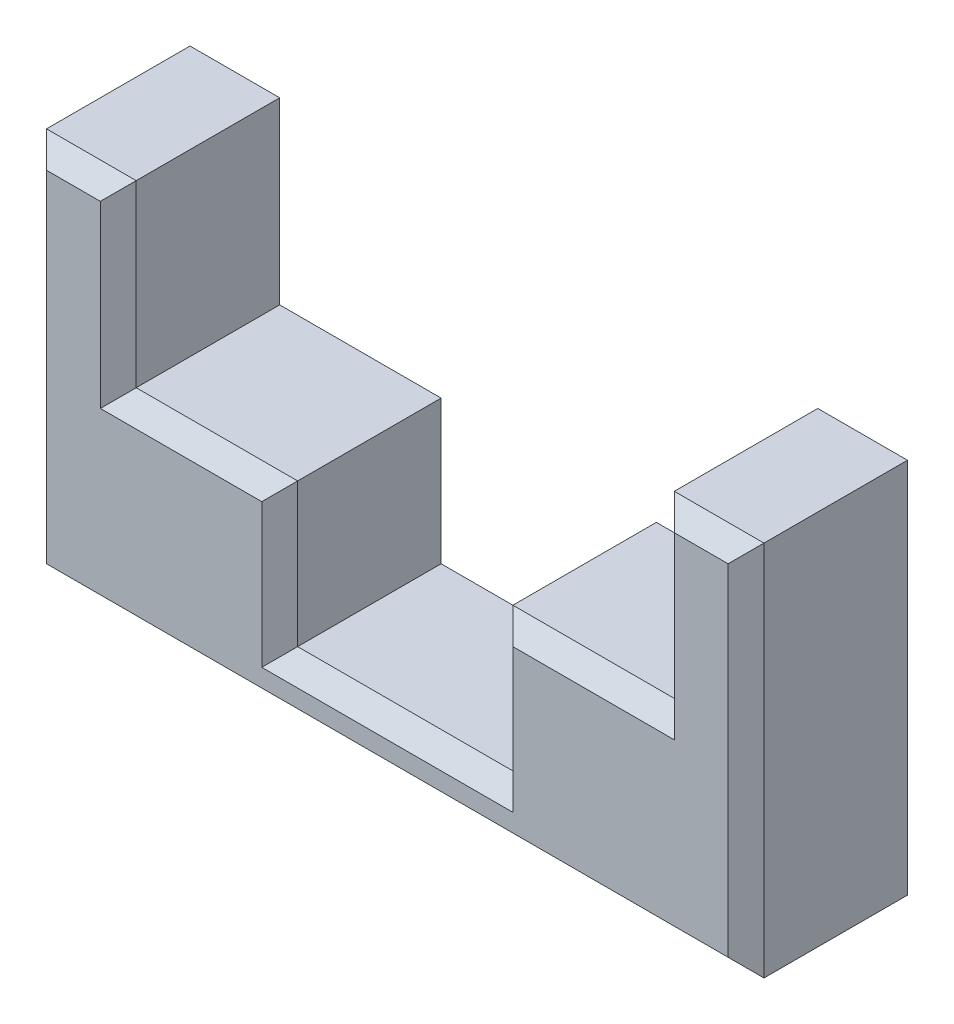
ISO-10303-21;
HEADER;
FILE_DESCRIPTION(('STEP AP214'),'2;1');
FILE_NAME('part.step','',(''),(''),'','','');
FILE_SCHEMA(('AUTOMOTIVE_DESIGN { 1 0 10303 214 1 1 1 1 }'));
ENDSEC;
DATA;
#1=APPLICATION_CONTEXT('core data for automotive mechanical design processes');
#2=APPLICATION_PROTOCOL_DEFINITION('international standard','automotive_design',2000,#1);
#3=PRODUCT_CONTEXT('',#1,'mechanical');
#4=PRODUCT('Part','Part','',(#3));
#5=PRODUCT_RELATED_PRODUCT_CATEGORY('part','',(#4));
#6=PRODUCT_DEFINITION_FORMATION('','',#4);
#7=PRODUCT_DEFINITION_CONTEXT('part definition',#1,'design');
#8=PRODUCT_DEFINITION('design','',#6,#7);
#9=PRODUCT_DEFINITION_SHAPE('','',#8);
#10=(LENGTH_UNIT() NAMED_UNIT(*) SI_UNIT(.MILLI.,.METRE.));
#11=(NAMED_UNIT(*) PLANE_ANGLE_UNIT() SI_UNIT($,.RADIAN.));
#12=(NAMED_UNIT(*) SI_UNIT($,.STERADIAN.) SOLID_ANGLE_UNIT());
#13=UNCERTAINTY_MEASURE_WITH_UNIT(LENGTH_MEASURE(1.E-05),#10,'distance_accuracy_value','');
#14=(GEOMETRIC_REPRESENTATION_CONTEXT(3) GLOBAL_UNCERTAINTY_ASSIGNED_CONTEXT((#13)) GLOBAL_UNIT_ASSIGNED_CONTEXT((#10,
#11,#12)) REPRESENTATION_CONTEXT('',''));
#15=CARTESIAN_POINT('',(0.,0.,0.));
#16=DIRECTION('',(0.,0.,1.));
#17=DIRECTION('',(1.,0.,0.));
#18=AXIS2_PLACEMENT_3D('',#15,#16,#17);
#19=CARTESIAN_POINT('',(15.7141207882353,0.,10.));
#20=DIRECTION('',(0.,-1.,0.));
#21=DIRECTION('',(0.,0.,-1.));
#22=AXIS2_PLACEMENT_3D('',#19,#20,#21);
#23=PLANE('',#22);
#24=DIRECTION('',(0.,0.,-1.));
#25=VECTOR('',#24,1.);
#26=CARTESIAN_POINT('',(15.7141207882353,0.,10.));
#27=LINE('',#26,#25);
#28=CARTESIAN_POINT('',(15.7141207882353,0.,9.));
#29=VERTEX_POINT('',#28);
#30=CARTESIAN_POINT('',(15.7141207882353,0.,1.));
#31=VERTEX_POINT('',#30);
#32=EDGE_CURVE('E217',#29,#31,#27,.T.);
#33=ORIENTED_EDGE('',*,*,#32,.F.);
#34=DIRECTION('',(1.,0.,0.));
#35=VECTOR('',#34,1.);
#36=CARTESIAN_POINT('',(20.7141207882353,0.,9.));
#37=LINE('',#36,#35);
#38=CARTESIAN_POINT('',(20.7141207882353,0.,9.));
#39=VERTEX_POINT('',#38);
#40=EDGE_CURVE('E274',#29,#39,#37,.T.);
#41=ORIENTED_EDGE('',*,*,#40,.T.);
#42=DIRECTION('',(0.,0.,-1.));
#43=VECTOR('',#42,1.);
#44=CARTESIAN_POINT('',(20.7141207882353,0.,10.));
#45=LINE('',#44,#43);
#46=CARTESIAN_POINT('',(20.7141207882353,0.,1.));
#47=VERTEX_POINT('',#46);
#48=EDGE_CURVE('E325',#39,#47,#45,.T.);
#49=ORIENTED_EDGE('',*,*,#48,.T.);
#50=DIRECTION('',(-1.,0.,0.));
#51=VECTOR('',#50,1.);
#52=CARTESIAN_POINT('',(15.7141207882353,0.,1.));
#53=LINE('',#52,#51);
#54=EDGE_CURVE('E272',#47,#31,#53,.T.);
#55=ORIENTED_EDGE('',*,*,#54,.T.);
#56=EDGE_LOOP('',(#33,#41,#49,#55));
#57=FACE_BOUND('',#56,.T.);
#58=ADVANCED_FACE('F35',(#57),#23,.F.);
#59=CARTESIAN_POINT('',(15.7141207882353,0.,10.));
#60=DIRECTION('',(1.,0.,0.));
#61=DIRECTION('',(0.,0.,-1.));
#62=AXIS2_PLACEMENT_3D('',#59,#60,#61);
#63=PLANE('',#62);
#64=DIRECTION('',(0.,0.,-1.));
#65=VECTOR('',#64,1.);
#66=CARTESIAN_POINT('',(15.7141207882353,-10.,10.));
#67=LINE('',#66,#65);
#68=CARTESIAN_POINT('',(15.7141207882353,-10.,9.));
#69=VERTEX_POINT('',#68);
#70=CARTESIAN_POINT('',(15.7141207882353,-10.,1.));
#71=VERTEX_POINT('',#70);
#72=EDGE_CURVE('E419',#69,#71,#67,.T.);
#73=ORIENTED_EDGE('',*,*,#72,.F.);
#74=DIRECTION('',(0.,1.,0.));
#75=VECTOR('',#74,1.);
#76=CARTESIAN_POINT('',(15.7141207882353,0.,9.));
#77=LINE('',#76,#75);
#78=EDGE_CURVE('E270',#69,#29,#77,.T.);
#79=ORIENTED_EDGE('',*,*,#78,.T.);
#80=ORIENTED_EDGE('',*,*,#32,.T.);
#81=DIRECTION('',(0.,-1.,0.));
#82=VECTOR('',#81,1.);
#83=CARTESIAN_POINT('',(15.7141207882353,0.,1.));
#84=LINE('',#83,#82);
#85=EDGE_CURVE('E267',#31,#71,#84,.T.);
#86=ORIENTED_EDGE('',*,*,#85,.T.);
#87=EDGE_LOOP('',(#73,#79,#80,#86));
#88=FACE_BOUND('',#87,.T.);
#89=ADVANCED_FACE('F516',(#88),#63,.F.);
#90=CARTESIAN_POINT('',(6.71412078823526,-10.,10.));
#91=DIRECTION('',(0.,-1.,0.));
#92=DIRECTION('',(1.,0.,0.));
#93=AXIS2_PLACEMENT_3D('',#90,#91,#92);
#94=PLANE('',#93);
#95=DIRECTION('',(0.,0.,-1.));
#96=VECTOR('',#95,1.);
#97=CARTESIAN_POINT('',(6.71412078823526,-10.,10.));
#98=LINE('',#97,#96);
#99=CARTESIAN_POINT('',(6.71412078823526,-10.,9.));
#100=VERTEX_POINT('',#99);
#101=CARTESIAN_POINT('',(6.71412078823526,-10.,1.));
#102=VERTEX_POINT('',#101);
#103=EDGE_CURVE('E416',#100,#102,#98,.T.);
#104=ORIENTED_EDGE('',*,*,#103,.F.);
#105=DIRECTION('',(1.,0.,0.));
#106=VECTOR('',#105,1.);
#107=CARTESIAN_POINT('',(15.7141207882353,-10.,9.));
#108=LINE('',#107,#106);
#109=EDGE_CURVE('E265',#100,#69,#108,.T.);
#110=ORIENTED_EDGE('',*,*,#109,.T.);
#111=ORIENTED_EDGE('',*,*,#72,.T.);
#112=DIRECTION('',(-1.,0.,0.));
#113=VECTOR('',#112,1.);
#114=CARTESIAN_POINT('',(6.71412078823526,-10.,1.));
#115=LINE('',#114,#113);
#116=EDGE_CURVE('E263',#71,#102,#115,.T.);
#117=ORIENTED_EDGE('',*,*,#116,.T.);
#118=EDGE_LOOP('',(#104,#110,#111,#117));
#119=FACE_BOUND('',#118,.T.);
#120=ADVANCED_FACE('F548',(#119),#94,.F.);
#121=CARTESIAN_POINT('',(6.71412078823526,-10.,10.));
#122=DIRECTION('',(1.,0.,0.));
#123=DIRECTION('',(0.,0.,-1.));
#124=AXIS2_PLACEMENT_3D('',#121,#122,#123);
#125=PLANE('',#124);
#126=DIRECTION('',(0.,0.,-1.));
#127=VECTOR('',#126,1.);
#128=CARTESIAN_POINT('',(6.71412078823526,-18.,10.));
#129=LINE('',#128,#127);
#130=CARTESIAN_POINT('',(6.71412078823526,-18.,9.));
#131=VERTEX_POINT('',#130);
#132=CARTESIAN_POINT('',(6.71412078823526,-18.,1.));
#133=VERTEX_POINT('',#132);
#134=EDGE_CURVE('E413',#131,#133,#129,.T.);
#135=ORIENTED_EDGE('',*,*,#134,.F.);
#136=DIRECTION('',(0.,1.,0.));
#137=VECTOR('',#136,1.);
#138=CARTESIAN_POINT('',(6.71412078823526,-10.,9.));
#139=LINE('',#138,#137);
#140=EDGE_CURVE('E261',#131,#100,#139,.T.);
#141=ORIENTED_EDGE('',*,*,#140,.T.);
#142=ORIENTED_EDGE('',*,*,#103,.T.);
#143=DIRECTION('',(0.,-1.,0.));
#144=VECTOR('',#143,1.);
#145=CARTESIAN_POINT('',(6.71412078823526,-10.,1.));
#146=LINE('',#145,#144);
#147=EDGE_CURVE('E259',#102,#133,#146,.T.);
#148=ORIENTED_EDGE('',*,*,#147,.T.);
#149=EDGE_LOOP('',(#135,#141,#142,#148));
#150=FACE_BOUND('',#149,.T.);
#151=ADVANCED_FACE('F799',(#150),#125,.F.);
#152=CARTESIAN_POINT('',(-5.28587921176474,-18.,10.));
#153=DIRECTION('',(0.,-1.,0.));
#154=DIRECTION('',(0.,0.,-1.));
#155=AXIS2_PLACEMENT_3D('',#152,#153,#154);
#156=PLANE('',#155);
#157=DIRECTION('',(0.,0.,-1.));
#158=VECTOR('',#157,1.);
#159=CARTESIAN_POINT('',(-5.28587921176474,-18.,10.));
#160=LINE('',#159,#158);
#161=CARTESIAN_POINT('',(-5.28587921176474,-18.,9.));
#162=VERTEX_POINT('',#161);
#163=CARTESIAN_POINT('',(-5.28587921176474,-18.,1.));
#164=VERTEX_POINT('',#163);
#165=EDGE_CURVE('E410',#162,#164,#160,.T.);
#166=ORIENTED_EDGE('',*,*,#165,.F.);
#167=DIRECTION('',(1.,0.,0.));
#168=VECTOR('',#167,1.);
#169=CARTESIAN_POINT('',(6.71412078823526,-18.,9.));
#170=LINE('',#169,#168);
#171=EDGE_CURVE('E257',#162,#131,#170,.T.);
#172=ORIENTED_EDGE('',*,*,#171,.T.);
#173=ORIENTED_EDGE('',*,*,#134,.T.);
#174=DIRECTION('',(-1.,0.,0.));
#175=VECTOR('',#174,1.);
#176=CARTESIAN_POINT('',(-5.28587921176474,-18.,1.));
#177=LINE('',#176,#175);
#178=EDGE_CURVE('E255',#133,#164,#177,.T.);
#179=ORIENTED_EDGE('',*,*,#178,.T.);
#180=EDGE_LOOP('',(#166,#172,#173,#179));
#181=FACE_BOUND('',#180,.T.);
#182=ADVANCED_FACE('F485',(#181),#156,.F.);
#183=CARTESIAN_POINT('',(-5.28587921176474,-10.,10.));
#184=DIRECTION('',(-1.,0.,0.));
#185=DIRECTION('',(0.,-1.,0.));
#186=AXIS2_PLACEMENT_3D('',#183,#184,#185);
#187=PLANE('',#186);
#188=DIRECTION('',(0.,0.,-1.));
#189=VECTOR('',#188,1.);
#190=CARTESIAN_POINT('',(-5.28587921176474,-10.,10.));
#191=LINE('',#190,#189);
#192=CARTESIAN_POINT('',(-5.28587921176474,-10.,9.));
#193=VERTEX_POINT('',#192);
#194=CARTESIAN_POINT('',(-5.28587921176474,-10.,1.));
#195=VERTEX_POINT('',#194);
#196=EDGE_CURVE('E407',#193,#195,#191,.T.);
#197=ORIENTED_EDGE('',*,*,#196,.F.);
#198=DIRECTION('',(0.,-1.,0.));
#199=VECTOR('',#198,1.);
#200=CARTESIAN_POINT('',(-5.28587921176474,-18.,9.));
#201=LINE('',#200,#199);
#202=EDGE_CURVE('E253',#193,#162,#201,.T.);
#203=ORIENTED_EDGE('',*,*,#202,.T.);
#204=ORIENTED_EDGE('',*,*,#165,.T.);
#205=DIRECTION('',(0.,1.,0.));
#206=VECTOR('',#205,1.);
#207=CARTESIAN_POINT('',(-5.28587921176474,-10.,1.));
#208=LINE('',#207,#206);
#209=EDGE_CURVE('E251',#164,#195,#208,.T.);
#210=ORIENTED_EDGE('',*,*,#209,.T.);
#211=EDGE_LOOP('',(#197,#203,#204,#210));
#212=FACE_BOUND('',#211,.T.);
#213=ADVANCED_FACE('F482',(#212),#187,.F.);
#214=CARTESIAN_POINT('',(-5.28587921176474,-10.,10.));
#215=DIRECTION('',(0.,-1.,0.));
#216=DIRECTION('',(0.,0.,-1.));
#217=AXIS2_PLACEMENT_3D('',#214,#215,#216);
#218=PLANE('',#217);
#219=DIRECTION('',(0.,0.,-1.));
#220=VECTOR('',#219,1.);
#221=CARTESIAN_POINT('',(-14.2858792117647,-10.,10.));
#222=LINE('',#221,#220);
#223=CARTESIAN_POINT('',(-14.2858792117647,-10.,9.));
#224=VERTEX_POINT('',#223);
#225=CARTESIAN_POINT('',(-14.2858792117647,-10.,1.));
#226=VERTEX_POINT('',#225);
#227=EDGE_CURVE('E404',#224,#226,#222,.T.);
#228=ORIENTED_EDGE('',*,*,#227,.F.);
#229=DIRECTION('',(1.,0.,0.));
#230=VECTOR('',#229,1.);
#231=CARTESIAN_POINT('',(-5.28587921176474,-10.,9.));
#232=LINE('',#231,#230);
#233=EDGE_CURVE('E249',#224,#193,#232,.T.);
#234=ORIENTED_EDGE('',*,*,#233,.T.);
#235=ORIENTED_EDGE('',*,*,#196,.T.);
#236=DIRECTION('',(-1.,0.,0.));
#237=VECTOR('',#236,1.);
#238=CARTESIAN_POINT('',(-5.28587921176474,-10.,1.));
#239=LINE('',#238,#237);
#240=EDGE_CURVE('E247',#195,#226,#239,.T.);
#241=ORIENTED_EDGE('',*,*,#240,.T.);
#242=EDGE_LOOP('',(#228,#234,#235,#241));
#243=FACE_BOUND('',#242,.T.);
#244=ADVANCED_FACE('F468',(#243),#218,.F.);
#245=CARTESIAN_POINT('',(-14.2858792117647,0.,10.));
#246=DIRECTION('',(-1.,0.,0.));
#247=DIRECTION('',(0.,-1.,0.));
#248=AXIS2_PLACEMENT_3D('',#245,#246,#247);
#249=PLANE('',#248);
#250=DIRECTION('',(0.,0.,-1.));
#251=VECTOR('',#250,1.);
#252=CARTESIAN_POINT('',(-14.2858792117647,0.,10.));
#253=LINE('',#252,#251);
#254=CARTESIAN_POINT('',(-14.2858792117647,0.,9.));
#255=VERTEX_POINT('',#254);
#256=CARTESIAN_POINT('',(-14.2858792117647,0.,1.));
#257=VERTEX_POINT('',#256);
#258=EDGE_CURVE('E401',#255,#257,#253,.T.);
#259=ORIENTED_EDGE('',*,*,#258,.F.);
#260=DIRECTION('',(0.,-1.,0.));
#261=VECTOR('',#260,1.);
#262=CARTESIAN_POINT('',(-14.2858792117647,-10.,9.));
#263=LINE('',#262,#261);
#264=EDGE_CURVE('E245',#255,#224,#263,.T.);
#265=ORIENTED_EDGE('',*,*,#264,.T.);
#266=ORIENTED_EDGE('',*,*,#227,.T.);
#267=DIRECTION('',(0.,1.,0.));
#268=VECTOR('',#267,1.);
#269=CARTESIAN_POINT('',(-14.2858792117647,0.,1.));
#270=LINE('',#269,#268);
#271=EDGE_CURVE('E243',#226,#257,#270,.T.);
#272=ORIENTED_EDGE('',*,*,#271,.T.);
#273=EDGE_LOOP('',(#259,#265,#266,#272));
#274=FACE_BOUND('',#273,.T.);
#275=ADVANCED_FACE('F465',(#274),#249,.F.);
#276=CARTESIAN_POINT('',(-19.2858792117647,0.,10.));
#277=DIRECTION('',(0.,-1.,0.));
#278=DIRECTION('',(0.,0.,-1.));
#279=AXIS2_PLACEMENT_3D('',#276,#277,#278);
#280=PLANE('',#279);
#281=DIRECTION('',(0.,0.,-1.));
#282=VECTOR('',#281,1.);
#283=CARTESIAN_POINT('',(-19.2858792117647,0.,10.));
#284=LINE('',#283,#282);
#285=CARTESIAN_POINT('',(-19.2858792117647,0.,9.));
#286=VERTEX_POINT('',#285);
#287=CARTESIAN_POINT('',(-19.2858792117647,0.,1.));
#288=VERTEX_POINT('',#287);
#289=EDGE_CURVE('E395',#286,#288,#284,.T.);
#290=ORIENTED_EDGE('',*,*,#289,.F.);
#291=DIRECTION('',(1.,0.,0.));
#292=VECTOR('',#291,1.);
#293=CARTESIAN_POINT('',(-14.2858792117647,0.,9.));
#294=LINE('',#293,#292);
#295=EDGE_CURVE('E241',#286,#255,#294,.T.);
#296=ORIENTED_EDGE('',*,*,#295,.T.);
#297=ORIENTED_EDGE('',*,*,#258,.T.);
#298=DIRECTION('',(-1.,0.,0.));
#299=VECTOR('',#298,1.);
#300=CARTESIAN_POINT('',(-19.2858792117647,0.,1.));
#301=LINE('',#300,#299);
#302=EDGE_CURVE('E239',#257,#288,#301,.T.);
#303=ORIENTED_EDGE('',*,*,#302,.T.);
#304=EDGE_LOOP('',(#290,#296,#297,#303));
#305=FACE_BOUND('',#304,.T.);
#306=ADVANCED_FACE('F453',(#305),#280,.F.);
#307=CARTESIAN_POINT('',(-19.2858792117647,0.,10.));
#308=DIRECTION('',(1.,0.,0.));
#309=DIRECTION('',(0.,0.,-1.));
#310=AXIS2_PLACEMENT_3D('',#307,#308,#309);
#311=PLANE('',#310);
#312=DIRECTION('',(0.,0.,-1.));
#313=VECTOR('',#312,1.);
#314=CARTESIAN_POINT('',(-19.2858792117647,-21.,10.));
#315=LINE('',#314,#313);
#316=CARTESIAN_POINT('',(-19.2858792117647,-21.,9.));
#317=VERTEX_POINT('',#316);
#318=CARTESIAN_POINT('',(-19.2858792117647,-21.,1.));
#319=VERTEX_POINT('',#318);
#320=EDGE_CURVE('E389',#317,#319,#315,.T.);
#321=ORIENTED_EDGE('',*,*,#320,.F.);
#322=DIRECTION('',(0.,1.,0.));
#323=VECTOR('',#322,1.);
#324=CARTESIAN_POINT('',(-19.2858792117647,0.,9.));
#325=LINE('',#324,#323);
#326=EDGE_CURVE('E237',#317,#286,#325,.T.);
#327=ORIENTED_EDGE('',*,*,#326,.T.);
#328=ORIENTED_EDGE('',*,*,#289,.T.);
#329=DIRECTION('',(0.,-1.,0.));
#330=VECTOR('',#329,1.);
#331=CARTESIAN_POINT('',(-19.2858792117647,0.,1.));
#332=LINE('',#331,#330);
#333=EDGE_CURVE('E235',#288,#319,#332,.T.);
#334=ORIENTED_EDGE('',*,*,#333,.T.);
#335=EDGE_LOOP('',(#321,#327,#328,#334));
#336=FACE_BOUND('',#335,.T.);
#337=ADVANCED_FACE('F449',(#336),#311,.F.);
#338=CARTESIAN_POINT('',(-19.2858792117647,-21.,10.));
#339=DIRECTION('',(0.,1.,0.));
#340=DIRECTION('',(0.,0.,1.));
#341=AXIS2_PLACEMENT_3D('',#338,#339,#340);
#342=PLANE('',#341);
#343=DIRECTION('',(0.,0.,-1.));
#344=VECTOR('',#343,1.);
#345=CARTESIAN_POINT('',(20.7141207882353,-21.,10.));
#346=LINE('',#345,#344);
#347=CARTESIAN_POINT('',(20.7141207882353,-21.,9.));
#348=VERTEX_POINT('',#347);
#349=CARTESIAN_POINT('',(20.7141207882353,-21.,1.));
#350=VERTEX_POINT('',#349);
#351=EDGE_CURVE('E387',#348,#350,#346,.T.);
#352=ORIENTED_EDGE('',*,*,#351,.F.);
#353=DIRECTION('',(-1.,0.,0.));
#354=VECTOR('',#353,1.);
#355=CARTESIAN_POINT('',(-19.2858792117647,-21.,9.));
#356=LINE('',#355,#354);
#357=EDGE_CURVE('E233',#348,#317,#356,.T.);
#358=ORIENTED_EDGE('',*,*,#357,.T.);
#359=ORIENTED_EDGE('',*,*,#320,.T.);
#360=DIRECTION('',(1.,0.,0.));
#361=VECTOR('',#360,1.);
#362=CARTESIAN_POINT('',(-19.2858792117647,-21.,1.));
#363=LINE('',#362,#361);
#364=EDGE_CURVE('E231',#319,#350,#363,.T.);
#365=ORIENTED_EDGE('',*,*,#364,.T.);
#366=EDGE_LOOP('',(#352,#358,#359,#365));
#367=FACE_BOUND('',#366,.T.);
#368=ADVANCED_FACE('F386',(#367),#342,.F.);
#369=CARTESIAN_POINT('',(20.7141207882353,-21.,10.));
#370=DIRECTION('',(-1.,0.,0.));
#371=DIRECTION('',(0.,0.,1.));
#372=AXIS2_PLACEMENT_3D('',#369,#370,#371);
#373=PLANE('',#372);
#374=ORIENTED_EDGE('',*,*,#48,.F.);
#375=DIRECTION('',(0.,-1.,0.));
#376=VECTOR('',#375,1.);
#377=CARTESIAN_POINT('',(20.7141207882353,-21.,9.));
#378=LINE('',#377,#376);
#379=EDGE_CURVE('E204',#39,#348,#378,.T.);
#380=ORIENTED_EDGE('',*,*,#379,.T.);
#381=ORIENTED_EDGE('',*,*,#351,.T.);
#382=DIRECTION('',(0.,1.,0.));
#383=VECTOR('',#382,1.);
#384=CARTESIAN_POINT('',(20.7141207882353,-21.,1.));
#385=LINE('',#384,#383);
#386=EDGE_CURVE('E223',#350,#47,#385,.T.);
#387=ORIENTED_EDGE('',*,*,#386,.T.);
#388=EDGE_LOOP('',(#374,#380,#381,#387));
#389=FACE_BOUND('',#388,.T.);
#390=ADVANCED_FACE('F392',(#389),#373,.F.);
#391=CARTESIAN_POINT('',(0.,0.,10.));
#392=DIRECTION('',(0.,0.,1.));
#393=DIRECTION('',(1.,0.,0.));
#394=AXIS2_PLACEMENT_3D('',#391,#392,#393);
#395=PLANE('',#394);
#396=DIRECTION('',(1.,0.,0.));
#397=VECTOR('',#396,1.);
#398=CARTESIAN_POINT('',(20.7141207882353,-20.,10.));
#399=LINE('',#398,#397);
#400=CARTESIAN_POINT('',(-18.2858792117647,-20.,10.));
#401=VERTEX_POINT('',#400);
#402=CARTESIAN_POINT('',(19.7141207882353,-20.,10.));
#403=VERTEX_POINT('',#402);
#404=EDGE_CURVE('E221',#401,#403,#399,.T.);
#405=ORIENTED_EDGE('',*,*,#404,.T.);
#406=DIRECTION('',(0.,1.,0.));
#407=VECTOR('',#406,1.);
#408=CARTESIAN_POINT('',(19.7141207882353,0.,10.));
#409=LINE('',#408,#407);
#410=CARTESIAN_POINT('',(19.7141207882353,-1.,10.));
#411=VERTEX_POINT('',#410);
#412=EDGE_CURVE('E202',#403,#411,#409,.T.);
#413=ORIENTED_EDGE('',*,*,#412,.T.);
#414=DIRECTION('',(-1.,0.,0.));
#415=VECTOR('',#414,1.);
#416=CARTESIAN_POINT('',(15.7141207882353,-1.,10.));
#417=LINE('',#416,#415);
#418=CARTESIAN_POINT('',(16.7141207882353,-1.,10.));
#419=VERTEX_POINT('',#418);
#420=EDGE_CURVE('E210',#411,#419,#417,.T.);
#421=ORIENTED_EDGE('',*,*,#420,.T.);
#422=DIRECTION('',(0.,-1.,0.));
#423=VECTOR('',#422,1.);
#424=CARTESIAN_POINT('',(16.7141207882353,-10.,10.));
#425=LINE('',#424,#423);
#426=CARTESIAN_POINT('',(16.7141207882353,-11.,10.));
#427=VERTEX_POINT('',#426);
#428=EDGE_CURVE('E216',#419,#427,#425,.T.);
#429=ORIENTED_EDGE('',*,*,#428,.T.);
#430=DIRECTION('',(-1.,0.,0.));
#431=VECTOR('',#430,1.);
#432=CARTESIAN_POINT('',(6.71412078823526,-11.,10.));
#433=LINE('',#432,#431);
#434=CARTESIAN_POINT('',(7.71412078823526,-11.,10.));
#435=VERTEX_POINT('',#434);
#436=EDGE_CURVE('E425',#427,#435,#433,.T.);
#437=ORIENTED_EDGE('',*,*,#436,.T.);
#438=DIRECTION('',(0.,-1.,0.));
#439=VECTOR('',#438,1.);
#440=CARTESIAN_POINT('',(7.71412078823526,-18.,10.));
#441=LINE('',#440,#439);
#442=CARTESIAN_POINT('',(7.71412078823526,-19.,10.));
#443=VERTEX_POINT('',#442);
#444=EDGE_CURVE('E427',#435,#443,#441,.T.);
#445=ORIENTED_EDGE('',*,*,#444,.T.);
#446=DIRECTION('',(-1.,0.,0.));
#447=VECTOR('',#446,1.);
#448=CARTESIAN_POINT('',(-5.28587921176474,-19.,10.));
#449=LINE('',#448,#447);
#450=CARTESIAN_POINT('',(-6.28587921176474,-19.,10.));
#451=VERTEX_POINT('',#450);
#452=EDGE_CURVE('E429',#443,#451,#449,.T.);
#453=ORIENTED_EDGE('',*,*,#452,.T.);
#454=DIRECTION('',(0.,1.,0.));
#455=VECTOR('',#454,1.);
#456=CARTESIAN_POINT('',(-6.28587921176475,-10.,10.));
#457=LINE('',#456,#455);
#458=CARTESIAN_POINT('',(-6.28587921176475,-11.,10.));
#459=VERTEX_POINT('',#458);
#460=EDGE_CURVE('E431',#451,#459,#457,.T.);
#461=ORIENTED_EDGE('',*,*,#460,.T.);
#462=DIRECTION('',(-1.,0.,0.));
#463=VECTOR('',#462,1.);
#464=CARTESIAN_POINT('',(-14.2858792117647,-11.,10.));
#465=LINE('',#464,#463);
#466=CARTESIAN_POINT('',(-15.2858792117647,-11.,10.));
#467=VERTEX_POINT('',#466);
#468=EDGE_CURVE('E433',#459,#467,#465,.T.);
#469=ORIENTED_EDGE('',*,*,#468,.T.);
#470=DIRECTION('',(0.,1.,0.));
#471=VECTOR('',#470,1.);
#472=CARTESIAN_POINT('',(-15.2858792117647,0.,10.));
#473=LINE('',#472,#471);
#474=CARTESIAN_POINT('',(-15.2858792117647,-1.,10.));
#475=VERTEX_POINT('',#474);
#476=EDGE_CURVE('E435',#467,#475,#473,.T.);
#477=ORIENTED_EDGE('',*,*,#476,.T.);
#478=DIRECTION('',(-1.,0.,0.));
#479=VECTOR('',#478,1.);
#480=CARTESIAN_POINT('',(-19.2858792117647,-1.,10.));
#481=LINE('',#480,#479);
#482=CARTESIAN_POINT('',(-18.2858792117647,-1.,10.));
#483=VERTEX_POINT('',#482);
#484=EDGE_CURVE('E437',#475,#483,#481,.T.);
#485=ORIENTED_EDGE('',*,*,#484,.T.);
#486=DIRECTION('',(0.,-1.,0.));
#487=VECTOR('',#486,1.);
#488=CARTESIAN_POINT('',(-18.2858792117647,-21.,10.));
#489=LINE('',#488,#487);
#490=EDGE_CURVE('E226',#483,#401,#489,.T.);
#491=ORIENTED_EDGE('',*,*,#490,.T.);
#492=EDGE_LOOP('',(#405,#413,#421,#429,#437,#445,#453,#461,#469,#477,#485,#491));
#493=FACE_BOUND('',#492,.T.);
#494=ADVANCED_FACE('F219',(#493),#395,.T.);
#495=CARTESIAN_POINT('',(0.,0.,0.));
#496=DIRECTION('',(0.,0.,1.));
#497=DIRECTION('',(1.,0.,0.));
#498=AXIS2_PLACEMENT_3D('',#495,#496,#497);
#499=PLANE('',#498);
#500=DIRECTION('',(1.,0.,0.));
#501=VECTOR('',#500,1.);
#502=CARTESIAN_POINT('',(0.,-11.,0.));
#503=LINE('',#502,#501);
#504=CARTESIAN_POINT('',(7.71412078823526,-11.,0.));
#505=VERTEX_POINT('',#504);
#506=CARTESIAN_POINT('',(16.7141207882353,-11.,0.));
#507=VERTEX_POINT('',#506);
#508=EDGE_CURVE('E45',#505,#507,#503,.T.);
#509=ORIENTED_EDGE('',*,*,#508,.T.);
#510=DIRECTION('',(0.,1.,0.));
#511=VECTOR('',#510,1.);
#512=CARTESIAN_POINT('',(16.7141207882353,0.,0.));
#513=LINE('',#512,#511);
#514=CARTESIAN_POINT('',(16.7141207882353,-1.,0.));
#515=VERTEX_POINT('',#514);
#516=EDGE_CURVE('E11',#507,#515,#513,.T.);
#517=ORIENTED_EDGE('',*,*,#516,.T.);
#518=DIRECTION('',(1.,0.,0.));
#519=VECTOR('',#518,1.);
#520=CARTESIAN_POINT('',(0.,-1.,0.));
#521=LINE('',#520,#519);
#522=CARTESIAN_POINT('',(19.7141207882353,-1.,0.));
#523=VERTEX_POINT('',#522);
#524=EDGE_CURVE('E276',#515,#523,#521,.T.);
#525=ORIENTED_EDGE('',*,*,#524,.T.);
#526=DIRECTION('',(0.,-1.,0.));
#527=VECTOR('',#526,1.);
#528=CARTESIAN_POINT('',(19.7141207882353,0.,0.));
#529=LINE('',#528,#527);
#530=CARTESIAN_POINT('',(19.7141207882353,-20.,0.));
#531=VERTEX_POINT('',#530);
#532=EDGE_CURVE('E278',#523,#531,#529,.T.);
#533=ORIENTED_EDGE('',*,*,#532,.T.);
#534=DIRECTION('',(-1.,0.,0.));
#535=VECTOR('',#534,1.);
#536=CARTESIAN_POINT('',(0.,-20.,0.));
#537=LINE('',#536,#535);
#538=CARTESIAN_POINT('',(-18.2858792117647,-20.,0.));
#539=VERTEX_POINT('',#538);
#540=EDGE_CURVE('E280',#531,#539,#537,.T.);
#541=ORIENTED_EDGE('',*,*,#540,.T.);
#542=DIRECTION('',(0.,1.,0.));
#543=VECTOR('',#542,1.);
#544=CARTESIAN_POINT('',(-18.2858792117647,0.,0.));
#545=LINE('',#544,#543);
#546=CARTESIAN_POINT('',(-18.2858792117647,-1.,0.));
#547=VERTEX_POINT('',#546);
#548=EDGE_CURVE('E282',#539,#547,#545,.T.);
#549=ORIENTED_EDGE('',*,*,#548,.T.);
#550=DIRECTION('',(1.,0.,0.));
#551=VECTOR('',#550,1.);
#552=CARTESIAN_POINT('',(0.,-1.,0.));
#553=LINE('',#552,#551);
#554=CARTESIAN_POINT('',(-15.2858792117647,-1.,0.));
#555=VERTEX_POINT('',#554);
#556=EDGE_CURVE('E284',#547,#555,#553,.T.);
#557=ORIENTED_EDGE('',*,*,#556,.T.);
#558=DIRECTION('',(0.,-1.,0.));
#559=VECTOR('',#558,1.);
#560=CARTESIAN_POINT('',(-15.2858792117647,0.,0.));
#561=LINE('',#560,#559);
#562=CARTESIAN_POINT('',(-15.2858792117647,-11.,0.));
#563=VERTEX_POINT('',#562);
#564=EDGE_CURVE('E286',#555,#563,#561,.T.);
#565=ORIENTED_EDGE('',*,*,#564,.T.);
#566=DIRECTION('',(1.,0.,0.));
#567=VECTOR('',#566,1.);
#568=CARTESIAN_POINT('',(0.,-11.,0.));
#569=LINE('',#568,#567);
#570=CARTESIAN_POINT('',(-6.28587921176475,-11.,0.));
#571=VERTEX_POINT('',#570);
#572=EDGE_CURVE('E288',#563,#571,#569,.T.);
#573=ORIENTED_EDGE('',*,*,#572,.T.);
#574=DIRECTION('',(0.,-1.,0.));
#575=VECTOR('',#574,1.);
#576=CARTESIAN_POINT('',(-6.28587921176475,0.,0.));
#577=LINE('',#576,#575);
#578=CARTESIAN_POINT('',(-6.28587921176474,-19.,0.));
#579=VERTEX_POINT('',#578);
#580=EDGE_CURVE('E290',#571,#579,#577,.T.);
#581=ORIENTED_EDGE('',*,*,#580,.T.);
#582=DIRECTION('',(1.,0.,0.));
#583=VECTOR('',#582,1.);
#584=CARTESIAN_POINT('',(0.,-19.,0.));
#585=LINE('',#584,#583);
#586=CARTESIAN_POINT('',(7.71412078823526,-19.,0.));
#587=VERTEX_POINT('',#586);
#588=EDGE_CURVE('E292',#579,#587,#585,.T.);
#589=ORIENTED_EDGE('',*,*,#588,.T.);
#590=DIRECTION('',(0.,1.,0.));
#591=VECTOR('',#590,1.);
#592=CARTESIAN_POINT('',(7.71412078823526,0.,0.));
#593=LINE('',#592,#591);
#594=EDGE_CURVE('E56',#587,#505,#593,.T.);
#595=ORIENTED_EDGE('',*,*,#594,.T.);
#596=EDGE_LOOP('',(#509,#517,#525,#533,#541,#549,#557,#565,#573,#581,#589,#595));
#597=FACE_BOUND('',#596,.T.);
#598=ADVANCED_FACE('F369',(#597),#499,.F.);
#599=CARTESIAN_POINT('',(-6.28587921176475,0.,10.));
#600=DIRECTION('',(0.707106781186548,0.,0.707106781186547));
#601=DIRECTION('',(0.,-1.,0.));
#602=AXIS2_PLACEMENT_3D('',#599,#600,#601);
#603=PLANE('',#602);
#604=DIRECTION('',(-0.577350269189626,-0.577350269189626,0.577350269189626));
#605=VECTOR('',#604,1.);
#606=CARTESIAN_POINT('',(0.0474541215685891,-12.6666666666667,3.66666666666667));
#607=LINE('',#606,#605);
#608=EDGE_CURVE('E319',#162,#451,#607,.T.);
#609=ORIENTED_EDGE('',*,*,#608,.F.);
#610=ORIENTED_EDGE('',*,*,#202,.F.);
#611=DIRECTION('',(-0.577350269189626,-0.577350269189626,0.577350269189626));
#612=VECTOR('',#611,1.);
#613=CARTESIAN_POINT('',(-2.61921254509808,-7.33333333333333,6.33333333333333));
#614=LINE('',#613,#612);
#615=EDGE_CURVE('E322',#459,#193,#614,.F.);
#616=ORIENTED_EDGE('',*,*,#615,.F.);
#617=ORIENTED_EDGE('',*,*,#460,.F.);
#618=EDGE_LOOP('',(#609,#610,#616,#617));
#619=FACE_BOUND('',#618,.T.);
#620=ADVANCED_FACE('F478',(#619),#603,.T.);
#621=CARTESIAN_POINT('',(0.,-11.,10.));
#622=DIRECTION('',(0.,0.707106781186547,0.707106781186547));
#623=DIRECTION('',(1.,0.,0.));
#624=AXIS2_PLACEMENT_3D('',#621,#622,#623);
#625=PLANE('',#624);
#626=ORIENTED_EDGE('',*,*,#615,.T.);
#627=ORIENTED_EDGE('',*,*,#233,.F.);
#628=DIRECTION('',(-0.577350269189626,-0.577350269189626,0.577350269189626));
#629=VECTOR('',#628,1.);
#630=CARTESIAN_POINT('',(-11.6192125450981,-7.33333333333333,6.33333333333333));
#631=LINE('',#630,#629);
#632=EDGE_CURVE('E316',#467,#224,#631,.F.);
#633=ORIENTED_EDGE('',*,*,#632,.F.);
#634=ORIENTED_EDGE('',*,*,#468,.F.);
#635=EDGE_LOOP('',(#626,#627,#633,#634));
#636=FACE_BOUND('',#635,.T.);
#637=ADVANCED_FACE('F471',(#636),#625,.T.);
#638=CARTESIAN_POINT('',(0.,-19.,10.));
#639=DIRECTION('',(0.,0.707106781186547,0.707106781186547));
#640=DIRECTION('',(1.,0.,0.));
#641=AXIS2_PLACEMENT_3D('',#638,#639,#640);
#642=PLANE('',#641);
#643=ORIENTED_EDGE('',*,*,#608,.T.);
#644=ORIENTED_EDGE('',*,*,#452,.F.);
#645=DIRECTION('',(0.577350269189626,-0.577350269189626,0.577350269189626));
#646=VECTOR('',#645,1.);
#647=CARTESIAN_POINT('',(5.14274719215684,-16.4286264039216,7.42862640392158));
#648=LINE('',#647,#646);
#649=EDGE_CURVE('E313',#131,#443,#648,.T.);
#650=ORIENTED_EDGE('',*,*,#649,.F.);
#651=ORIENTED_EDGE('',*,*,#171,.F.);
#652=EDGE_LOOP('',(#643,#644,#650,#651));
#653=FACE_BOUND('',#652,.T.);
#654=ADVANCED_FACE('F533',(#653),#642,.T.);
#655=CARTESIAN_POINT('',(-15.2858792117647,0.,10.));
#656=DIRECTION('',(0.707106781186547,0.,0.707106781186547));
#657=DIRECTION('',(0.,-1.,0.));
#658=AXIS2_PLACEMENT_3D('',#655,#656,#657);
#659=PLANE('',#658);
#660=ORIENTED_EDGE('',*,*,#632,.T.);
#661=ORIENTED_EDGE('',*,*,#264,.F.);
#662=DIRECTION('',(-0.577350269189626,-0.577350269189626,0.577350269189626));
#663=VECTOR('',#662,1.);
#664=CARTESIAN_POINT('',(-14.9525458784314,-0.666666666666668,9.66666666666667));
#665=LINE('',#664,#663);
#666=EDGE_CURVE('E310',#475,#255,#665,.F.);
#667=ORIENTED_EDGE('',*,*,#666,.F.);
#668=ORIENTED_EDGE('',*,*,#476,.F.);
#669=EDGE_LOOP('',(#660,#661,#667,#668));
#670=FACE_BOUND('',#669,.T.);
#671=ADVANCED_FACE('F461',(#670),#659,.T.);
#672=CARTESIAN_POINT('',(7.71412078823526,0.,10.));
#673=DIRECTION('',(-0.707106781186547,0.,0.707106781186547));
#674=DIRECTION('',(0.,1.,0.));
#675=AXIS2_PLACEMENT_3D('',#672,#673,#674);
#676=PLANE('',#675);
#677=ORIENTED_EDGE('',*,*,#649,.T.);
#678=ORIENTED_EDGE('',*,*,#444,.F.);
#679=DIRECTION('',(0.577350269189626,-0.577350269189626,0.577350269189626));
#680=VECTOR('',#679,1.);
#681=CARTESIAN_POINT('',(5.14274719215684,-8.42862640392158,7.42862640392158));
#682=LINE('',#681,#680);
#683=EDGE_CURVE('E307',#100,#435,#682,.T.);
#684=ORIENTED_EDGE('',*,*,#683,.F.);
#685=ORIENTED_EDGE('',*,*,#140,.F.);
#686=EDGE_LOOP('',(#677,#678,#684,#685));
#687=FACE_BOUND('',#686,.T.);
#688=ADVANCED_FACE('F529',(#687),#676,.T.);
#689=CARTESIAN_POINT('',(0.,-1.,10.));
#690=DIRECTION('',(0.,0.707106781186547,0.707106781186547));
#691=DIRECTION('',(1.,0.,0.));
#692=AXIS2_PLACEMENT_3D('',#689,#690,#691);
#693=PLANE('',#692);
#694=ORIENTED_EDGE('',*,*,#666,.T.);
#695=ORIENTED_EDGE('',*,*,#295,.F.);
#696=DIRECTION('',(0.577350269189626,-0.577350269189626,0.577350269189626));
#697=VECTOR('',#696,1.);
#698=CARTESIAN_POINT('',(-12.1905861411765,-7.09529307058825,16.0952930705883));
#699=LINE('',#698,#697);
#700=EDGE_CURVE('E304',#483,#286,#699,.F.);
#701=ORIENTED_EDGE('',*,*,#700,.F.);
#702=ORIENTED_EDGE('',*,*,#484,.F.);
#703=EDGE_LOOP('',(#694,#695,#701,#702));
#704=FACE_BOUND('',#703,.T.);
#705=ADVANCED_FACE('F456',(#704),#693,.T.);
#706=CARTESIAN_POINT('',(0.,-11.,10.));
#707=DIRECTION('',(0.,0.707106781186548,0.707106781186547));
#708=DIRECTION('',(1.,0.,0.));
#709=AXIS2_PLACEMENT_3D('',#706,#707,#708);
#710=PLANE('',#709);
#711=ORIENTED_EDGE('',*,*,#683,.T.);
#712=ORIENTED_EDGE('',*,*,#436,.F.);
#713=DIRECTION('',(0.577350269189626,-0.577350269189626,0.577350269189626));
#714=VECTOR('',#713,1.);
#715=CARTESIAN_POINT('',(11.1427471921568,-5.42862640392158,4.42862640392158));
#716=LINE('',#715,#714);
#717=EDGE_CURVE('E301',#69,#427,#716,.T.);
#718=ORIENTED_EDGE('',*,*,#717,.F.);
#719=ORIENTED_EDGE('',*,*,#109,.F.);
#720=EDGE_LOOP('',(#711,#712,#718,#719));
#721=FACE_BOUND('',#720,.T.);
#722=ADVANCED_FACE('F524',(#721),#710,.T.);
#723=CARTESIAN_POINT('',(-18.2858792117647,0.,10.));
#724=DIRECTION('',(-0.707106781186547,0.,0.707106781186547));
#725=DIRECTION('',(0.,1.,0.));
#726=AXIS2_PLACEMENT_3D('',#723,#724,#725);
#727=PLANE('',#726);
#728=ORIENTED_EDGE('',*,*,#700,.T.);
#729=ORIENTED_EDGE('',*,*,#326,.F.);
#730=DIRECTION('',(0.577350269189626,0.577350269189626,0.577350269189626));
#731=VECTOR('',#730,1.);
#732=CARTESIAN_POINT('',(-11.6192125450981,-13.3333333333333,16.6666666666667));
#733=LINE('',#732,#731);
#734=EDGE_CURVE('E298',#401,#317,#733,.F.);
#735=ORIENTED_EDGE('',*,*,#734,.F.);
#736=ORIENTED_EDGE('',*,*,#490,.F.);
#737=EDGE_LOOP('',(#728,#729,#735,#736));
#738=FACE_BOUND('',#737,.T.);
#739=ADVANCED_FACE('F444',(#738),#727,.T.);
#740=CARTESIAN_POINT('',(16.7141207882353,0.,10.));
#741=DIRECTION('',(-0.707106781186547,0.,0.707106781186547));
#742=DIRECTION('',(0.,1.,0.));
#743=AXIS2_PLACEMENT_3D('',#740,#741,#742);
#744=PLANE('',#743);
#745=ORIENTED_EDGE('',*,*,#717,.T.);
#746=ORIENTED_EDGE('',*,*,#428,.F.);
#747=DIRECTION('',(0.577350269189626,-0.577350269189626,0.577350269189626));
#748=VECTOR('',#747,1.);
#749=CARTESIAN_POINT('',(11.1427471921568,4.57137359607842,4.42862640392158));
#750=LINE('',#749,#748);
#751=EDGE_CURVE('E213',#29,#419,#750,.T.);
#752=ORIENTED_EDGE('',*,*,#751,.F.);
#753=ORIENTED_EDGE('',*,*,#78,.F.);
#754=EDGE_LOOP('',(#745,#746,#752,#753));
#755=FACE_BOUND('',#754,.T.);
#756=ADVANCED_FACE('F520',(#755),#744,.T.);
#757=CARTESIAN_POINT('',(0.,-20.,10.));
#758=DIRECTION('',(0.,-0.707106781186547,0.707106781186547));
#759=DIRECTION('',(-1.,0.,0.));
#760=AXIS2_PLACEMENT_3D('',#757,#758,#759);
#761=PLANE('',#760);
#762=ORIENTED_EDGE('',*,*,#734,.T.);
#763=ORIENTED_EDGE('',*,*,#357,.F.);
#764=DIRECTION('',(-0.577350269189626,0.577350269189626,0.577350269189626));
#765=VECTOR('',#764,1.);
#766=CARTESIAN_POINT('',(13.1427471921568,-13.4286264039216,16.5713735960784));
#767=LINE('',#766,#765);
#768=EDGE_CURVE('E207',#403,#348,#767,.F.);
#769=ORIENTED_EDGE('',*,*,#768,.F.);
#770=ORIENTED_EDGE('',*,*,#404,.F.);
#771=EDGE_LOOP('',(#762,#763,#769,#770));
#772=FACE_BOUND('',#771,.T.);
#773=ADVANCED_FACE('F447',(#772),#761,.T.);
#774=CARTESIAN_POINT('',(0.,-1.,10.));
#775=DIRECTION('',(0.,0.707106781186547,0.707106781186547));
#776=DIRECTION('',(1.,0.,0.));
#777=AXIS2_PLACEMENT_3D('',#774,#775,#776);
#778=PLANE('',#777);
#779=ORIENTED_EDGE('',*,*,#751,.T.);
#780=ORIENTED_EDGE('',*,*,#420,.F.);
#781=DIRECTION('',(0.577350269189626,0.577350269189626,-0.577350269189626));
#782=VECTOR('',#781,1.);
#783=CARTESIAN_POINT('',(13.1427471921568,-7.57137359607842,16.5713735960784));
#784=LINE('',#783,#782);
#785=EDGE_CURVE('E198',#39,#411,#784,.F.);
#786=ORIENTED_EDGE('',*,*,#785,.F.);
#787=ORIENTED_EDGE('',*,*,#40,.F.);
#788=EDGE_LOOP('',(#779,#780,#786,#787));
#789=FACE_BOUND('',#788,.T.);
#790=ADVANCED_FACE('F211',(#789),#778,.T.);
#791=CARTESIAN_POINT('',(19.7141207882353,0.,10.));
#792=DIRECTION('',(0.707106781186547,0.,0.707106781186547));
#793=DIRECTION('',(0.,-1.,0.));
#794=AXIS2_PLACEMENT_3D('',#791,#792,#793);
#795=PLANE('',#794);
#796=ORIENTED_EDGE('',*,*,#768,.T.);
#797=ORIENTED_EDGE('',*,*,#379,.F.);
#798=ORIENTED_EDGE('',*,*,#785,.T.);
#799=ORIENTED_EDGE('',*,*,#412,.F.);
#800=EDGE_LOOP('',(#796,#797,#798,#799));
#801=FACE_BOUND('',#800,.T.);
#802=ADVANCED_FACE('F200',(#801),#795,.T.);
#803=CARTESIAN_POINT('',(-14.2858792117647,0.,1.));
#804=DIRECTION('',(-0.707106781186547,0.,0.707106781186547));
#805=DIRECTION('',(0.,1.,0.));
#806=AXIS2_PLACEMENT_3D('',#803,#804,#805);
#807=PLANE('',#806);
#808=DIRECTION('',(-0.577350269189626,-0.577350269189626,-0.577350269189626));
#809=VECTOR('',#808,1.);
#810=CARTESIAN_POINT('',(-11.2858792117647,-7.,4.));
#811=LINE('',#810,#809);
#812=EDGE_CURVE('E353',#563,#226,#811,.F.);
#813=ORIENTED_EDGE('',*,*,#812,.F.);
#814=ORIENTED_EDGE('',*,*,#564,.F.);
#815=DIRECTION('',(-0.577350269189626,-0.577350269189626,-0.577350269189626));
#816=VECTOR('',#815,1.);
#817=CARTESIAN_POINT('',(-15.9525458784314,-1.66666666666667,-0.666666666666666));
#818=LINE('',#817,#816);
#819=EDGE_CURVE('E40',#257,#555,#818,.T.);
#820=ORIENTED_EDGE('',*,*,#819,.F.);
#821=ORIENTED_EDGE('',*,*,#271,.F.);
#822=EDGE_LOOP('',(#813,#814,#820,#821));
#823=FACE_BOUND('',#822,.T.);
#824=ADVANCED_FACE('F38',(#823),#807,.F.);
#825=CARTESIAN_POINT('',(-19.2858792117647,0.,1.));
#826=DIRECTION('',(0.,-0.707106781186547,0.707106781186547));
#827=DIRECTION('',(-1.,0.,0.));
#828=AXIS2_PLACEMENT_3D('',#825,#826,#827);
#829=PLANE('',#828);
#830=ORIENTED_EDGE('',*,*,#819,.T.);
#831=ORIENTED_EDGE('',*,*,#556,.F.);
#832=DIRECTION('',(0.577350269189626,-0.577350269189626,-0.577350269189626));
#833=VECTOR('',#832,1.);
#834=CARTESIAN_POINT('',(-19.2858792117647,0.,1.));
#835=LINE('',#834,#833);
#836=EDGE_CURVE('E351',#288,#547,#835,.T.);
#837=ORIENTED_EDGE('',*,*,#836,.F.);
#838=ORIENTED_EDGE('',*,*,#302,.F.);
#839=EDGE_LOOP('',(#830,#831,#837,#838));
#840=FACE_BOUND('',#839,.T.);
#841=ADVANCED_FACE('F364',(#840),#829,.F.);
#842=CARTESIAN_POINT('',(-5.28587921176474,-10.,1.));
#843=DIRECTION('',(0.,-0.707106781186547,0.707106781186547));
#844=DIRECTION('',(-1.,0.,0.));
#845=AXIS2_PLACEMENT_3D('',#842,#843,#844);
#846=PLANE('',#845);
#847=ORIENTED_EDGE('',*,*,#812,.T.);
#848=ORIENTED_EDGE('',*,*,#240,.F.);
#849=DIRECTION('',(-0.577350269189626,-0.577350269189626,-0.577350269189626));
#850=VECTOR('',#849,1.);
#851=CARTESIAN_POINT('',(-5.28587921176474,-10.,1.));
#852=LINE('',#851,#850);
#853=EDGE_CURVE('E348',#571,#195,#852,.F.);
#854=ORIENTED_EDGE('',*,*,#853,.F.);
#855=ORIENTED_EDGE('',*,*,#572,.F.);
#856=EDGE_LOOP('',(#847,#848,#854,#855));
#857=FACE_BOUND('',#856,.T.);
#858=ADVANCED_FACE('F653',(#857),#846,.F.);
#859=CARTESIAN_POINT('',(-19.2858792117647,0.,1.));
#860=DIRECTION('',(0.707106781186547,0.,0.707106781186547));
#861=DIRECTION('',(0.,-1.,0.));
#862=AXIS2_PLACEMENT_3D('',#859,#860,#861);
#863=PLANE('',#862);
#864=ORIENTED_EDGE('',*,*,#836,.T.);
#865=ORIENTED_EDGE('',*,*,#548,.F.);
#866=DIRECTION('',(0.577350269189626,0.577350269189626,-0.577350269189626));
#867=VECTOR('',#866,1.);
#868=CARTESIAN_POINT('',(-19.2858792117647,-21.,1.));
#869=LINE('',#868,#867);
#870=EDGE_CURVE('E345',#319,#539,#869,.T.);
#871=ORIENTED_EDGE('',*,*,#870,.F.);
#872=ORIENTED_EDGE('',*,*,#333,.F.);
#873=EDGE_LOOP('',(#864,#865,#871,#872));
#874=FACE_BOUND('',#873,.T.);
#875=ADVANCED_FACE('F375',(#874),#863,.F.);
#876=CARTESIAN_POINT('',(-5.28587921176474,-10.,1.));
#877=DIRECTION('',(-0.707106781186548,0.,0.707106781186547));
#878=DIRECTION('',(0.,1.,0.));
#879=AXIS2_PLACEMENT_3D('',#876,#877,#878);
#880=PLANE('',#879);
#881=ORIENTED_EDGE('',*,*,#853,.T.);
#882=ORIENTED_EDGE('',*,*,#209,.F.);
#883=DIRECTION('',(-0.577350269189626,-0.577350269189626,-0.577350269189626));
#884=VECTOR('',#883,1.);
#885=CARTESIAN_POINT('',(-5.28587921176474,-18.,1.));
#886=LINE('',#885,#884);
#887=EDGE_CURVE('E342',#579,#164,#886,.F.);
#888=ORIENTED_EDGE('',*,*,#887,.F.);
#889=ORIENTED_EDGE('',*,*,#580,.F.);
#890=EDGE_LOOP('',(#881,#882,#888,#889));
#891=FACE_BOUND('',#890,.T.);
#892=ADVANCED_FACE('F641',(#891),#880,.F.);
#893=CARTESIAN_POINT('',(-19.2858792117647,-21.,1.));
#894=DIRECTION('',(0.,0.707106781186547,0.707106781186547));
#895=DIRECTION('',(1.,0.,0.));
#896=AXIS2_PLACEMENT_3D('',#893,#894,#895);
#897=PLANE('',#896);
#898=ORIENTED_EDGE('',*,*,#870,.T.);
#899=ORIENTED_EDGE('',*,*,#540,.F.);
#900=DIRECTION('',(-0.577350269189626,0.577350269189626,-0.577350269189626));
#901=VECTOR('',#900,1.);
#902=CARTESIAN_POINT('',(20.7141207882353,-21.,1.));
#903=LINE('',#902,#901);
#904=EDGE_CURVE('E339',#350,#531,#903,.T.);
#905=ORIENTED_EDGE('',*,*,#904,.F.);
#906=ORIENTED_EDGE('',*,*,#364,.F.);
#907=EDGE_LOOP('',(#898,#899,#905,#906));
#908=FACE_BOUND('',#907,.T.);
#909=ADVANCED_FACE('F379',(#908),#897,.F.);
#910=CARTESIAN_POINT('',(-5.28587921176474,-18.,1.));
#911=DIRECTION('',(0.,-0.707106781186547,0.707106781186547));
#912=DIRECTION('',(-1.,0.,0.));
#913=AXIS2_PLACEMENT_3D('',#910,#911,#912);
#914=PLANE('',#913);
#915=ORIENTED_EDGE('',*,*,#887,.T.);
#916=ORIENTED_EDGE('',*,*,#178,.F.);
#917=DIRECTION('',(0.577350269189626,-0.577350269189626,-0.577350269189626));
#918=VECTOR('',#917,1.);
#919=CARTESIAN_POINT('',(4.04745412156859,-15.3333333333333,3.66666666666667));
#920=LINE('',#919,#918);
#921=EDGE_CURVE('E336',#587,#133,#920,.F.);
#922=ORIENTED_EDGE('',*,*,#921,.F.);
#923=ORIENTED_EDGE('',*,*,#588,.F.);
#924=EDGE_LOOP('',(#915,#916,#922,#923));
#925=FACE_BOUND('',#924,.T.);
#926=ADVANCED_FACE('F490',(#925),#914,.F.);
#927=CARTESIAN_POINT('',(20.7141207882353,-21.,1.));
#928=DIRECTION('',(-0.707106781186547,0.,0.707106781186547));
#929=DIRECTION('',(0.,1.,0.));
#930=AXIS2_PLACEMENT_3D('',#927,#928,#929);
#931=PLANE('',#930);
#932=ORIENTED_EDGE('',*,*,#904,.T.);
#933=ORIENTED_EDGE('',*,*,#532,.F.);
#934=DIRECTION('',(-0.577350269189626,-0.577350269189626,-0.577350269189626));
#935=VECTOR('',#934,1.);
#936=CARTESIAN_POINT('',(19.0474541215686,-1.66666666666667,-0.666666666666667));
#937=LINE('',#936,#935);
#938=EDGE_CURVE('E333',#47,#523,#937,.T.);
#939=ORIENTED_EDGE('',*,*,#938,.F.);
#940=ORIENTED_EDGE('',*,*,#386,.F.);
#941=EDGE_LOOP('',(#932,#933,#939,#940));
#942=FACE_BOUND('',#941,.T.);
#943=ADVANCED_FACE('F509',(#942),#931,.F.);
#944=CARTESIAN_POINT('',(6.71412078823526,-10.,1.));
#945=DIRECTION('',(0.707106781186547,0.,0.707106781186547));
#946=DIRECTION('',(0.,-1.,0.));
#947=AXIS2_PLACEMENT_3D('',#944,#945,#946);
#948=PLANE('',#947);
#949=ORIENTED_EDGE('',*,*,#921,.T.);
#950=ORIENTED_EDGE('',*,*,#147,.F.);
#951=DIRECTION('',(0.577350269189626,-0.577350269189626,-0.577350269189626));
#952=VECTOR('',#951,1.);
#953=CARTESIAN_POINT('',(6.71412078823526,-10.,1.));
#954=LINE('',#953,#952);
#955=EDGE_CURVE('E330',#505,#102,#954,.F.);
#956=ORIENTED_EDGE('',*,*,#955,.F.);
#957=ORIENTED_EDGE('',*,*,#594,.F.);
#958=EDGE_LOOP('',(#949,#950,#956,#957));
#959=FACE_BOUND('',#958,.T.);
#960=ADVANCED_FACE('F495',(#959),#948,.F.);
#961=CARTESIAN_POINT('',(15.7141207882353,0.,1.));
#962=DIRECTION('',(0.,-0.707106781186547,0.707106781186547));
#963=DIRECTION('',(-1.,0.,0.));
#964=AXIS2_PLACEMENT_3D('',#961,#962,#963);
#965=PLANE('',#964);
#966=ORIENTED_EDGE('',*,*,#938,.T.);
#967=ORIENTED_EDGE('',*,*,#524,.F.);
#968=DIRECTION('',(-0.577350269189626,0.577350269189626,0.577350269189626));
#969=VECTOR('',#968,1.);
#970=CARTESIAN_POINT('',(15.7141207882353,0.,1.));
#971=LINE('',#970,#969);
#972=EDGE_CURVE('E328',#31,#515,#971,.F.);
#973=ORIENTED_EDGE('',*,*,#972,.F.);
#974=ORIENTED_EDGE('',*,*,#54,.F.);
#975=EDGE_LOOP('',(#966,#967,#973,#974));
#976=FACE_BOUND('',#975,.T.);
#977=ADVANCED_FACE('F511',(#976),#965,.F.);
#978=CARTESIAN_POINT('',(6.71412078823526,-10.,1.));
#979=DIRECTION('',(0.,-0.707106781186548,0.707106781186547));
#980=DIRECTION('',(-1.,0.,0.));
#981=AXIS2_PLACEMENT_3D('',#978,#979,#980);
#982=PLANE('',#981);
#983=ORIENTED_EDGE('',*,*,#955,.T.);
#984=ORIENTED_EDGE('',*,*,#116,.F.);
#985=DIRECTION('',(0.577350269189626,-0.577350269189626,-0.577350269189626));
#986=VECTOR('',#985,1.);
#987=CARTESIAN_POINT('',(12.3807874549019,-6.66666666666667,4.33333333333333));
#988=LINE('',#987,#986);
#989=EDGE_CURVE('E326',#507,#71,#988,.F.);
#990=ORIENTED_EDGE('',*,*,#989,.F.);
#991=ORIENTED_EDGE('',*,*,#508,.F.);
#992=EDGE_LOOP('',(#983,#984,#990,#991));
#993=FACE_BOUND('',#992,.T.);
#994=ADVANCED_FACE('F499',(#993),#982,.F.);
#995=CARTESIAN_POINT('',(15.7141207882353,0.,1.));
#996=DIRECTION('',(0.707106781186547,0.,0.707106781186547));
#997=DIRECTION('',(0.,-1.,0.));
#998=AXIS2_PLACEMENT_3D('',#995,#996,#997);
#999=PLANE('',#998);
#1000=ORIENTED_EDGE('',*,*,#972,.T.);
#1001=ORIENTED_EDGE('',*,*,#516,.F.);
#1002=ORIENTED_EDGE('',*,*,#989,.T.);
#1003=ORIENTED_EDGE('',*,*,#85,.F.);
#1004=EDGE_LOOP('',(#1000,#1001,#1002,#1003));
#1005=FACE_BOUND('',#1004,.T.);
#1006=ADVANCED_FACE('F502',(#1005),#999,.F.);
#1007=CLOSED_SHELL('',(#58,#89,#120,#151,#182,#213,#244,#275,#306,#337,#368,#390,#494,#598,#620,
#637,#654,#671,#688,#705,#722,#739,#756,#773,#790,#802,#824,#841,#858,#875,#892,#909,#926,#943,
#960,#977,#994,#1006));
#1008=MANIFOLD_SOLID_BREP('B2',#1007);
#1009=ADVANCED_BREP_SHAPE_REPRESENTATION('',(#18,#1008),#14);
#1010=SHAPE_DEFINITION_REPRESENTATION(#9,#1009);
ENDSEC;
END-ISO-10303-21;
